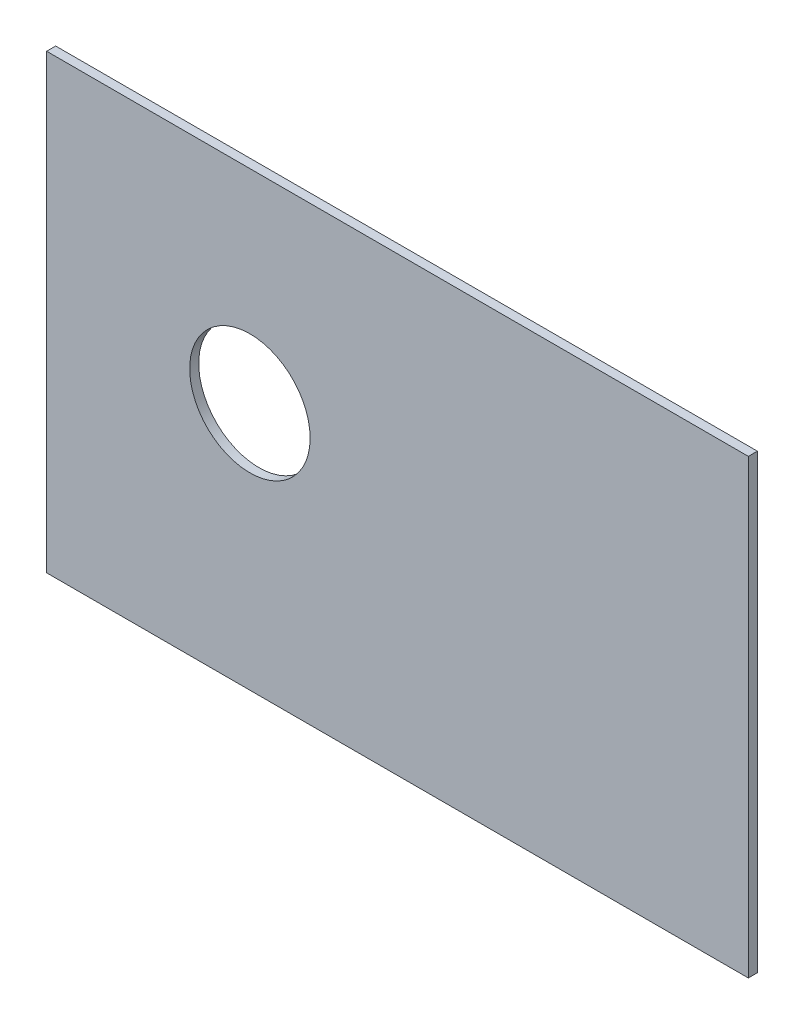
ISO-10303-21;
HEADER;
FILE_DESCRIPTION(('STEP AP214'),'2;1');
FILE_NAME('part.step','',(''),(''),'','','');
FILE_SCHEMA(('AUTOMOTIVE_DESIGN { 1 0 10303 214 1 1 1 1 }'));
ENDSEC;
DATA;
#1=APPLICATION_CONTEXT('core data for automotive mechanical design processes');
#2=APPLICATION_PROTOCOL_DEFINITION('international standard','automotive_design',2000,#1);
#3=PRODUCT_CONTEXT('',#1,'mechanical');
#4=PRODUCT('Part','Part','',(#3));
#5=PRODUCT_RELATED_PRODUCT_CATEGORY('part','',(#4));
#6=PRODUCT_DEFINITION_FORMATION('','',#4);
#7=PRODUCT_DEFINITION_CONTEXT('part definition',#1,'design');
#8=PRODUCT_DEFINITION('design','',#6,#7);
#9=PRODUCT_DEFINITION_SHAPE('','',#8);
#10=(LENGTH_UNIT() NAMED_UNIT(*) SI_UNIT(.MILLI.,.METRE.));
#11=(NAMED_UNIT(*) PLANE_ANGLE_UNIT() SI_UNIT($,.RADIAN.));
#12=(NAMED_UNIT(*) SI_UNIT($,.STERADIAN.) SOLID_ANGLE_UNIT());
#13=UNCERTAINTY_MEASURE_WITH_UNIT(LENGTH_MEASURE(1.E-05),#10,'distance_accuracy_value','');
#14=(GEOMETRIC_REPRESENTATION_CONTEXT(3) GLOBAL_UNCERTAINTY_ASSIGNED_CONTEXT((#13)) GLOBAL_UNIT_ASSIGNED_CONTEXT((#10,
#11,#12)) REPRESENTATION_CONTEXT('',''));
#15=CARTESIAN_POINT('',(0.,0.,0.));
#16=DIRECTION('',(0.,0.,1.));
#17=DIRECTION('',(1.,0.,0.));
#18=AXIS2_PLACEMENT_3D('',#15,#16,#17);
#19=CARTESIAN_POINT('',(116.5,0.,3.));
#20=DIRECTION('',(1.,0.,0.));
#21=DIRECTION('',(0.,1.,0.));
#22=AXIS2_PLACEMENT_3D('',#19,#20,#21);
#23=PLANE('',#22);
#24=DIRECTION('',(0.,-1.,0.));
#25=VECTOR('',#24,1.);
#26=CARTESIAN_POINT('',(116.5,0.,0.));
#27=LINE('',#26,#25);
#28=CARTESIAN_POINT('',(116.5,104.,0.));
#29=VERTEX_POINT('',#28);
#30=CARTESIAN_POINT('',(116.5,-46.,0.));
#31=VERTEX_POINT('',#30);
#32=EDGE_CURVE('E99',#29,#31,#27,.T.);
#33=ORIENTED_EDGE('',*,*,#32,.F.);
#34=DIRECTION('',(0.,0.,-1.));
#35=VECTOR('',#34,1.);
#36=CARTESIAN_POINT('',(116.5,104.,3.));
#37=LINE('',#36,#35);
#38=CARTESIAN_POINT('',(116.5,104.,3.));
#39=VERTEX_POINT('',#38);
#40=EDGE_CURVE('E11',#39,#29,#37,.T.);
#41=ORIENTED_EDGE('',*,*,#40,.F.);
#42=DIRECTION('',(0.,-1.,0.));
#43=VECTOR('',#42,1.);
#44=CARTESIAN_POINT('',(116.5,0.,3.));
#45=LINE('',#44,#43);
#46=CARTESIAN_POINT('',(116.5,-46.,3.));
#47=VERTEX_POINT('',#46);
#48=EDGE_CURVE('E92',#39,#47,#45,.T.);
#49=ORIENTED_EDGE('',*,*,#48,.T.);
#50=DIRECTION('',(0.,0.,-1.));
#51=VECTOR('',#50,1.);
#52=CARTESIAN_POINT('',(116.5,-46.,3.));
#53=LINE('',#52,#51);
#54=EDGE_CURVE('E73',#47,#31,#53,.T.);
#55=ORIENTED_EDGE('',*,*,#54,.T.);
#56=EDGE_LOOP('',(#33,#41,#49,#55));
#57=FACE_BOUND('',#56,.T.);
#58=ADVANCED_FACE('F35',(#57),#23,.T.);
#59=CARTESIAN_POINT('',(0.,104.,3.));
#60=DIRECTION('',(0.,1.,0.));
#61=DIRECTION('',(0.,0.,1.));
#62=AXIS2_PLACEMENT_3D('',#59,#60,#61);
#63=PLANE('',#62);
#64=DIRECTION('',(1.,0.,0.));
#65=VECTOR('',#64,1.);
#66=CARTESIAN_POINT('',(0.,104.,0.));
#67=LINE('',#66,#65);
#68=CARTESIAN_POINT('',(-116.5,104.,0.));
#69=VERTEX_POINT('',#68);
#70=EDGE_CURVE('E86',#69,#29,#67,.T.);
#71=ORIENTED_EDGE('',*,*,#70,.F.);
#72=DIRECTION('',(0.,0.,-1.));
#73=VECTOR('',#72,1.);
#74=CARTESIAN_POINT('',(-116.5,104.,3.));
#75=LINE('',#74,#73);
#76=CARTESIAN_POINT('',(-116.5,104.,3.));
#77=VERTEX_POINT('',#76);
#78=EDGE_CURVE('E43',#77,#69,#75,.T.);
#79=ORIENTED_EDGE('',*,*,#78,.F.);
#80=DIRECTION('',(1.,0.,0.));
#81=VECTOR('',#80,1.);
#82=CARTESIAN_POINT('',(0.,104.,3.));
#83=LINE('',#82,#81);
#84=EDGE_CURVE('E84',#77,#39,#83,.T.);
#85=ORIENTED_EDGE('',*,*,#84,.T.);
#86=ORIENTED_EDGE('',*,*,#40,.T.);
#87=EDGE_LOOP('',(#71,#79,#85,#86));
#88=FACE_BOUND('',#87,.T.);
#89=ADVANCED_FACE('F82',(#88),#63,.T.);
#90=CARTESIAN_POINT('',(-116.5,0.,3.));
#91=DIRECTION('',(1.,0.,0.));
#92=DIRECTION('',(0.,1.,0.));
#93=AXIS2_PLACEMENT_3D('',#90,#91,#92);
#94=PLANE('',#93);
#95=DIRECTION('',(0.,-1.,0.));
#96=VECTOR('',#95,1.);
#97=CARTESIAN_POINT('',(-116.5,0.,0.));
#98=LINE('',#97,#96);
#99=CARTESIAN_POINT('',(-116.5,-46.,0.));
#100=VERTEX_POINT('',#99);
#101=EDGE_CURVE('E66',#69,#100,#98,.T.);
#102=ORIENTED_EDGE('',*,*,#101,.T.);
#103=DIRECTION('',(0.,0.,-1.));
#104=VECTOR('',#103,1.);
#105=CARTESIAN_POINT('',(-116.5,-46.,3.));
#106=LINE('',#105,#104);
#107=CARTESIAN_POINT('',(-116.5,-46.,3.));
#108=VERTEX_POINT('',#107);
#109=EDGE_CURVE('E87',#108,#100,#106,.T.);
#110=ORIENTED_EDGE('',*,*,#109,.F.);
#111=DIRECTION('',(0.,-1.,0.));
#112=VECTOR('',#111,1.);
#113=CARTESIAN_POINT('',(-116.5,0.,3.));
#114=LINE('',#113,#112);
#115=EDGE_CURVE('E88',#77,#108,#114,.T.);
#116=ORIENTED_EDGE('',*,*,#115,.F.);
#117=ORIENTED_EDGE('',*,*,#78,.T.);
#118=EDGE_LOOP('',(#102,#110,#116,#117));
#119=FACE_BOUND('',#118,.T.);
#120=ADVANCED_FACE('F89',(#119),#94,.F.);
#121=CARTESIAN_POINT('',(0.,-46.,3.));
#122=DIRECTION('',(0.,1.,0.));
#123=DIRECTION('',(-1.,0.,0.));
#124=AXIS2_PLACEMENT_3D('',#121,#122,#123);
#125=PLANE('',#124);
#126=DIRECTION('',(1.,0.,0.));
#127=VECTOR('',#126,1.);
#128=CARTESIAN_POINT('',(0.,-46.,0.));
#129=LINE('',#128,#127);
#130=EDGE_CURVE('E94',#100,#31,#129,.T.);
#131=ORIENTED_EDGE('',*,*,#130,.T.);
#132=ORIENTED_EDGE('',*,*,#54,.F.);
#133=DIRECTION('',(1.,0.,0.));
#134=VECTOR('',#133,1.);
#135=CARTESIAN_POINT('',(0.,-46.,3.));
#136=LINE('',#135,#134);
#137=EDGE_CURVE('E51',#108,#47,#136,.T.);
#138=ORIENTED_EDGE('',*,*,#137,.F.);
#139=ORIENTED_EDGE('',*,*,#109,.T.);
#140=EDGE_LOOP('',(#131,#132,#138,#139));
#141=FACE_BOUND('',#140,.T.);
#142=ADVANCED_FACE('F109',(#141),#125,.F.);
#143=CARTESIAN_POINT('',(0.,0.,3.));
#144=DIRECTION('',(0.,0.,1.));
#145=DIRECTION('',(1.,0.,0.));
#146=AXIS2_PLACEMENT_3D('',#143,#144,#145);
#147=PLANE('',#146);
#148=CARTESIAN_POINT('',(-48.9999999999998,36.5,3.));
#149=DIRECTION('',(0.,0.,1.));
#150=DIRECTION('',(1.,0.,0.));
#151=AXIS2_PLACEMENT_3D('',#148,#149,#150);
#152=CIRCLE('',#151,20.);
#153=CARTESIAN_POINT('',(-28.9999999999998,36.5,3.));
#154=VERTEX_POINT('',#153);
#155=EDGE_CURVE('E139',#154,#154,#152,.T.);
#156=ORIENTED_EDGE('',*,*,#155,.F.);
#157=EDGE_LOOP('',(#156));
#158=FACE_BOUND('',#157,.T.);
#159=ORIENTED_EDGE('',*,*,#48,.F.);
#160=ORIENTED_EDGE('',*,*,#84,.F.);
#161=ORIENTED_EDGE('',*,*,#115,.T.);
#162=ORIENTED_EDGE('',*,*,#137,.T.);
#163=EDGE_LOOP('',(#159,#160,#161,#162));
#164=FACE_BOUND('',#163,.T.);
#165=ADVANCED_FACE('F91',(#158,#164),#147,.T.);
#166=CARTESIAN_POINT('',(0.,0.,0.));
#167=DIRECTION('',(0.,0.,1.));
#168=DIRECTION('',(1.,0.,0.));
#169=AXIS2_PLACEMENT_3D('',#166,#167,#168);
#170=PLANE('',#169);
#171=CARTESIAN_POINT('',(-48.9999999999998,36.5,0.));
#172=DIRECTION('',(0.,0.,1.));
#173=DIRECTION('',(1.,0.,0.));
#174=AXIS2_PLACEMENT_3D('',#171,#172,#173);
#175=CIRCLE('',#174,20.);
#176=CARTESIAN_POINT('',(-28.9999999999998,36.5,0.));
#177=VERTEX_POINT('',#176);
#178=EDGE_CURVE('E102',#177,#177,#175,.T.);
#179=ORIENTED_EDGE('',*,*,#178,.T.);
#180=EDGE_LOOP('',(#179));
#181=FACE_BOUND('',#180,.T.);
#182=ORIENTED_EDGE('',*,*,#32,.T.);
#183=ORIENTED_EDGE('',*,*,#130,.F.);
#184=ORIENTED_EDGE('',*,*,#101,.F.);
#185=ORIENTED_EDGE('',*,*,#70,.T.);
#186=EDGE_LOOP('',(#182,#183,#184,#185));
#187=FACE_BOUND('',#186,.T.);
#188=ADVANCED_FACE('F111',(#181,#187),#170,.F.);
#189=CARTESIAN_POINT('',(-48.9999999999998,36.5,0.));
#190=DIRECTION('',(0.,0.,1.));
#191=DIRECTION('',(1.,0.,0.));
#192=AXIS2_PLACEMENT_3D('',#189,#190,#191);
#193=CYLINDRICAL_SURFACE('',#192,20.);
#194=ORIENTED_EDGE('',*,*,#178,.F.);
#195=EDGE_LOOP('',(#194));
#196=FACE_BOUND('',#195,.T.);
#197=ORIENTED_EDGE('',*,*,#155,.T.);
#198=EDGE_LOOP('',(#197));
#199=FACE_BOUND('',#198,.T.);
#200=ADVANCED_FACE('F125',(#196,#199),#193,.F.);
#201=CLOSED_SHELL('',(#58,#89,#120,#142,#165,#188,#200));
#202=MANIFOLD_SOLID_BREP('B2',#201);
#203=ADVANCED_BREP_SHAPE_REPRESENTATION('',(#18,#202),#14);
#204=SHAPE_DEFINITION_REPRESENTATION(#9,#203);
ENDSEC;
END-ISO-10303-21;
